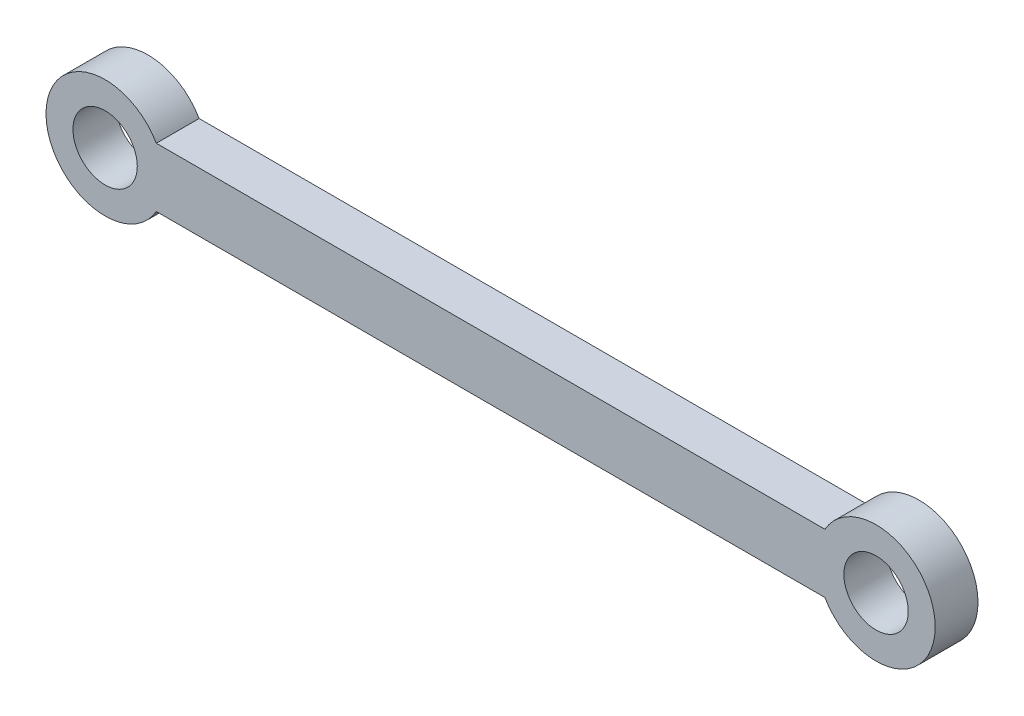
ISO-10303-21;
HEADER;
FILE_DESCRIPTION(('STEP AP214'),'2;1');
FILE_NAME('part.step','',(''),(''),'','','');
FILE_SCHEMA(('AUTOMOTIVE_DESIGN { 1 0 10303 214 1 1 1 1 }'));
ENDSEC;
DATA;
#1=APPLICATION_CONTEXT('core data for automotive mechanical design processes');
#2=APPLICATION_PROTOCOL_DEFINITION('international standard','automotive_design',2000,#1);
#3=PRODUCT_CONTEXT('',#1,'mechanical');
#4=PRODUCT('Part','Part','',(#3));
#5=PRODUCT_RELATED_PRODUCT_CATEGORY('part','',(#4));
#6=PRODUCT_DEFINITION_FORMATION('','',#4);
#7=PRODUCT_DEFINITION_CONTEXT('part definition',#1,'design');
#8=PRODUCT_DEFINITION('design','',#6,#7);
#9=PRODUCT_DEFINITION_SHAPE('','',#8);
#10=(LENGTH_UNIT() NAMED_UNIT(*) SI_UNIT(.MILLI.,.METRE.));
#11=(NAMED_UNIT(*) PLANE_ANGLE_UNIT() SI_UNIT($,.RADIAN.));
#12=(NAMED_UNIT(*) SI_UNIT($,.STERADIAN.) SOLID_ANGLE_UNIT());
#13=UNCERTAINTY_MEASURE_WITH_UNIT(LENGTH_MEASURE(1.E-05),#10,'distance_accuracy_value','');
#14=(GEOMETRIC_REPRESENTATION_CONTEXT(3) GLOBAL_UNCERTAINTY_ASSIGNED_CONTEXT((#13)) GLOBAL_UNIT_ASSIGNED_CONTEXT((#10,
#11,#12)) REPRESENTATION_CONTEXT('',''));
#15=CARTESIAN_POINT('',(0.,0.,0.));
#16=DIRECTION('',(0.,0.,1.));
#17=DIRECTION('',(1.,0.,0.));
#18=AXIS2_PLACEMENT_3D('',#15,#16,#17);
#19=CARTESIAN_POINT('',(-45.,0.,5.));
#20=DIRECTION('',(0.,0.,1.));
#21=DIRECTION('',(1.,0.,0.));
#22=AXIS2_PLACEMENT_3D('',#19,#20,#21);
#23=PLANE('',#22);
#24=CARTESIAN_POINT('',(-45.,0.,5.));
#25=DIRECTION('',(0.,0.,1.));
#26=DIRECTION('',(1.,0.,0.));
#27=AXIS2_PLACEMENT_3D('',#24,#25,#26);
#28=CIRCLE('',#27,3.75646198138566);
#29=CARTESIAN_POINT('',(-41.2435380186143,0.,5.));
#30=VERTEX_POINT('',#29);
#31=EDGE_CURVE('E105',#30,#30,#28,.T.);
#32=ORIENTED_EDGE('',*,*,#31,.F.);
#33=EDGE_LOOP('',(#32));
#34=FACE_BOUND('',#33,.T.);
#35=CARTESIAN_POINT('',(-45.,0.,5.));
#36=DIRECTION('',(0.,0.,1.));
#37=DIRECTION('',(1.,0.,0.));
#38=AXIS2_PLACEMENT_3D('',#35,#36,#37);
#39=CIRCLE('',#38,6.90106469149956);
#40=CARTESIAN_POINT('',(-39.0235026640016,3.45053234574979,5.));
#41=VERTEX_POINT('',#40);
#42=CARTESIAN_POINT('',(-39.0235026640016,-3.45053234574981,5.));
#43=VERTEX_POINT('',#42);
#44=EDGE_CURVE('E90',#41,#43,#39,.T.);
#45=ORIENTED_EDGE('',*,*,#44,.T.);
#46=DIRECTION('',(1.,0.,0.));
#47=VECTOR('',#46,1.);
#48=CARTESIAN_POINT('',(-39.0235026640016,-3.45053234574981,5.));
#49=LINE('',#48,#47);
#50=CARTESIAN_POINT('',(39.0235026640016,-3.4505323457498,5.));
#51=VERTEX_POINT('',#50);
#52=EDGE_CURVE('E85',#43,#51,#49,.T.);
#53=ORIENTED_EDGE('',*,*,#52,.T.);
#54=CARTESIAN_POINT('',(45.,0.,5.));
#55=DIRECTION('',(0.,0.,1.));
#56=DIRECTION('',(-1.,0.,0.));
#57=AXIS2_PLACEMENT_3D('',#54,#55,#56);
#58=CIRCLE('',#57,6.90106469149956);
#59=CARTESIAN_POINT('',(39.0235026640015,3.4505323457498,5.));
#60=VERTEX_POINT('',#59);
#61=EDGE_CURVE('E88',#51,#60,#58,.T.);
#62=ORIENTED_EDGE('',*,*,#61,.T.);
#63=DIRECTION('',(-1.,0.,0.));
#64=VECTOR('',#63,1.);
#65=CARTESIAN_POINT('',(-39.0235026640016,3.45053234574979,5.));
#66=LINE('',#65,#64);
#67=EDGE_CURVE('E55',#60,#41,#66,.T.);
#68=ORIENTED_EDGE('',*,*,#67,.T.);
#69=EDGE_LOOP('',(#45,#53,#62,#68));
#70=FACE_BOUND('',#69,.T.);
#71=CARTESIAN_POINT('',(45.,0.,5.));
#72=DIRECTION('',(0.,0.,1.));
#73=DIRECTION('',(-1.,0.,0.));
#74=AXIS2_PLACEMENT_3D('',#71,#72,#73);
#75=CIRCLE('',#74,3.75646198138566);
#76=CARTESIAN_POINT('',(41.2435380186143,0.,5.));
#77=VERTEX_POINT('',#76);
#78=EDGE_CURVE('E120',#77,#77,#75,.T.);
#79=ORIENTED_EDGE('',*,*,#78,.F.);
#80=EDGE_LOOP('',(#79));
#81=FACE_BOUND('',#80,.T.);
#82=ADVANCED_FACE('F38',(#34,#70,#81),#23,.T.);
#83=CARTESIAN_POINT('',(-45.,0.,0.));
#84=DIRECTION('',(0.,0.,1.));
#85=DIRECTION('',(1.,0.,0.));
#86=AXIS2_PLACEMENT_3D('',#83,#84,#85);
#87=PLANE('',#86);
#88=CARTESIAN_POINT('',(-45.,0.,0.));
#89=DIRECTION('',(0.,0.,1.));
#90=DIRECTION('',(1.,0.,0.));
#91=AXIS2_PLACEMENT_3D('',#88,#89,#90);
#92=CIRCLE('',#91,6.90106469149956);
#93=CARTESIAN_POINT('',(-39.0235026640016,3.45053234574979,0.));
#94=VERTEX_POINT('',#93);
#95=CARTESIAN_POINT('',(-39.0235026640016,-3.45053234574981,0.));
#96=VERTEX_POINT('',#95);
#97=EDGE_CURVE('E102',#94,#96,#92,.T.);
#98=ORIENTED_EDGE('',*,*,#97,.F.);
#99=DIRECTION('',(-1.,0.,0.));
#100=VECTOR('',#99,1.);
#101=CARTESIAN_POINT('',(-39.0235026640016,3.45053234574979,0.));
#102=LINE('',#101,#100);
#103=CARTESIAN_POINT('',(39.0235026640015,3.4505323457498,0.));
#104=VERTEX_POINT('',#103);
#105=EDGE_CURVE('E78',#104,#94,#102,.T.);
#106=ORIENTED_EDGE('',*,*,#105,.F.);
#107=CARTESIAN_POINT('',(45.,0.,0.));
#108=DIRECTION('',(0.,0.,1.));
#109=DIRECTION('',(-1.,0.,0.));
#110=AXIS2_PLACEMENT_3D('',#107,#108,#109);
#111=CIRCLE('',#110,6.90106469149956);
#112=CARTESIAN_POINT('',(39.0235026640016,-3.4505323457498,0.));
#113=VERTEX_POINT('',#112);
#114=EDGE_CURVE('E72',#113,#104,#111,.T.);
#115=ORIENTED_EDGE('',*,*,#114,.F.);
#116=DIRECTION('',(1.,0.,0.));
#117=VECTOR('',#116,1.);
#118=CARTESIAN_POINT('',(-39.0235026640016,-3.45053234574981,0.));
#119=LINE('',#118,#117);
#120=EDGE_CURVE('E94',#96,#113,#119,.T.);
#121=ORIENTED_EDGE('',*,*,#120,.F.);
#122=EDGE_LOOP('',(#98,#106,#115,#121));
#123=FACE_BOUND('',#122,.T.);
#124=CARTESIAN_POINT('',(-45.,0.,0.));
#125=DIRECTION('',(0.,0.,1.));
#126=DIRECTION('',(1.,0.,0.));
#127=AXIS2_PLACEMENT_3D('',#124,#125,#126);
#128=CIRCLE('',#127,3.75646198138566);
#129=CARTESIAN_POINT('',(-41.2435380186143,0.,0.));
#130=VERTEX_POINT('',#129);
#131=EDGE_CURVE('E117',#130,#130,#128,.T.);
#132=ORIENTED_EDGE('',*,*,#131,.T.);
#133=EDGE_LOOP('',(#132));
#134=FACE_BOUND('',#133,.T.);
#135=CARTESIAN_POINT('',(45.,0.,0.));
#136=DIRECTION('',(0.,0.,1.));
#137=DIRECTION('',(-1.,0.,0.));
#138=AXIS2_PLACEMENT_3D('',#135,#136,#137);
#139=CIRCLE('',#138,3.75646198138566);
#140=CARTESIAN_POINT('',(41.2435380186143,0.,0.));
#141=VERTEX_POINT('',#140);
#142=EDGE_CURVE('E123',#141,#141,#139,.T.);
#143=ORIENTED_EDGE('',*,*,#142,.T.);
#144=EDGE_LOOP('',(#143));
#145=FACE_BOUND('',#144,.T.);
#146=ADVANCED_FACE('F113',(#123,#134,#145),#87,.F.);
#147=CARTESIAN_POINT('',(-45.,0.,5.));
#148=DIRECTION('',(0.,0.,-1.));
#149=DIRECTION('',(-1.,0.,0.));
#150=AXIS2_PLACEMENT_3D('',#147,#148,#149);
#151=CYLINDRICAL_SURFACE('',#150,6.90106469149956);
#152=ORIENTED_EDGE('',*,*,#97,.T.);
#153=DIRECTION('',(0.,0.,-1.));
#154=VECTOR('',#153,1.);
#155=CARTESIAN_POINT('',(-39.0235026640016,-3.45053234574981,5.));
#156=LINE('',#155,#154);
#157=EDGE_CURVE('E11',#43,#96,#156,.T.);
#158=ORIENTED_EDGE('',*,*,#157,.F.);
#159=ORIENTED_EDGE('',*,*,#44,.F.);
#160=DIRECTION('',(0.,0.,-1.));
#161=VECTOR('',#160,1.);
#162=CARTESIAN_POINT('',(-39.0235026640016,3.45053234574979,5.));
#163=LINE('',#162,#161);
#164=EDGE_CURVE('E98',#41,#94,#163,.T.);
#165=ORIENTED_EDGE('',*,*,#164,.T.);
#166=EDGE_LOOP('',(#152,#158,#159,#165));
#167=FACE_BOUND('',#166,.T.);
#168=ADVANCED_FACE('F40',(#167),#151,.T.);
#169=CARTESIAN_POINT('',(-39.0235026640016,-3.45053234574981,5.));
#170=DIRECTION('',(0.,1.,0.));
#171=DIRECTION('',(-1.,0.,0.));
#172=AXIS2_PLACEMENT_3D('',#169,#170,#171);
#173=PLANE('',#172);
#174=ORIENTED_EDGE('',*,*,#120,.T.);
#175=DIRECTION('',(0.,0.,-1.));
#176=VECTOR('',#175,1.);
#177=CARTESIAN_POINT('',(39.0235026640016,-3.4505323457498,5.));
#178=LINE('',#177,#176);
#179=EDGE_CURVE('E47',#51,#113,#178,.T.);
#180=ORIENTED_EDGE('',*,*,#179,.F.);
#181=ORIENTED_EDGE('',*,*,#52,.F.);
#182=ORIENTED_EDGE('',*,*,#157,.T.);
#183=EDGE_LOOP('',(#174,#180,#181,#182));
#184=FACE_BOUND('',#183,.T.);
#185=ADVANCED_FACE('F93',(#184),#173,.F.);
#186=CARTESIAN_POINT('',(45.,0.,5.));
#187=DIRECTION('',(0.,0.,-1.));
#188=DIRECTION('',(-1.,0.,0.));
#189=AXIS2_PLACEMENT_3D('',#186,#187,#188);
#190=CYLINDRICAL_SURFACE('',#189,6.90106469149956);
#191=ORIENTED_EDGE('',*,*,#114,.T.);
#192=DIRECTION('',(0.,0.,-1.));
#193=VECTOR('',#192,1.);
#194=CARTESIAN_POINT('',(39.0235026640015,3.4505323457498,5.));
#195=LINE('',#194,#193);
#196=EDGE_CURVE('E95',#60,#104,#195,.T.);
#197=ORIENTED_EDGE('',*,*,#196,.F.);
#198=ORIENTED_EDGE('',*,*,#61,.F.);
#199=ORIENTED_EDGE('',*,*,#179,.T.);
#200=EDGE_LOOP('',(#191,#197,#198,#199));
#201=FACE_BOUND('',#200,.T.);
#202=ADVANCED_FACE('F96',(#201),#190,.T.);
#203=CARTESIAN_POINT('',(-39.0235026640016,3.45053234574979,5.));
#204=DIRECTION('',(0.,-1.,0.));
#205=DIRECTION('',(1.,0.,0.));
#206=AXIS2_PLACEMENT_3D('',#203,#204,#205);
#207=PLANE('',#206);
#208=ORIENTED_EDGE('',*,*,#105,.T.);
#209=ORIENTED_EDGE('',*,*,#164,.F.);
#210=ORIENTED_EDGE('',*,*,#67,.F.);
#211=ORIENTED_EDGE('',*,*,#196,.T.);
#212=EDGE_LOOP('',(#208,#209,#210,#211));
#213=FACE_BOUND('',#212,.T.);
#214=ADVANCED_FACE('F110',(#213),#207,.F.);
#215=CARTESIAN_POINT('',(-45.,0.,5.));
#216=DIRECTION('',(0.,0.,-1.));
#217=DIRECTION('',(-1.,0.,0.));
#218=AXIS2_PLACEMENT_3D('',#215,#216,#217);
#219=CYLINDRICAL_SURFACE('',#218,3.75646198138566);
#220=ORIENTED_EDGE('',*,*,#31,.T.);
#221=EDGE_LOOP('',(#220));
#222=FACE_BOUND('',#221,.T.);
#223=ORIENTED_EDGE('',*,*,#131,.F.);
#224=EDGE_LOOP('',(#223));
#225=FACE_BOUND('',#224,.T.);
#226=ADVANCED_FACE('F140',(#222,#225),#219,.F.);
#227=CARTESIAN_POINT('',(45.,0.,5.));
#228=DIRECTION('',(0.,0.,-1.));
#229=DIRECTION('',(-1.,0.,0.));
#230=AXIS2_PLACEMENT_3D('',#227,#228,#229);
#231=CYLINDRICAL_SURFACE('',#230,3.75646198138566);
#232=ORIENTED_EDGE('',*,*,#78,.T.);
#233=EDGE_LOOP('',(#232));
#234=FACE_BOUND('',#233,.T.);
#235=ORIENTED_EDGE('',*,*,#142,.F.);
#236=EDGE_LOOP('',(#235));
#237=FACE_BOUND('',#236,.T.);
#238=ADVANCED_FACE('F129',(#234,#237),#231,.F.);
#239=CLOSED_SHELL('',(#82,#146,#168,#185,#202,#214,#226,#238));
#240=MANIFOLD_SOLID_BREP('B2',#239);
#241=ADVANCED_BREP_SHAPE_REPRESENTATION('',(#18,#240),#14);
#242=SHAPE_DEFINITION_REPRESENTATION(#9,#241);
ENDSEC;
END-ISO-10303-21;
